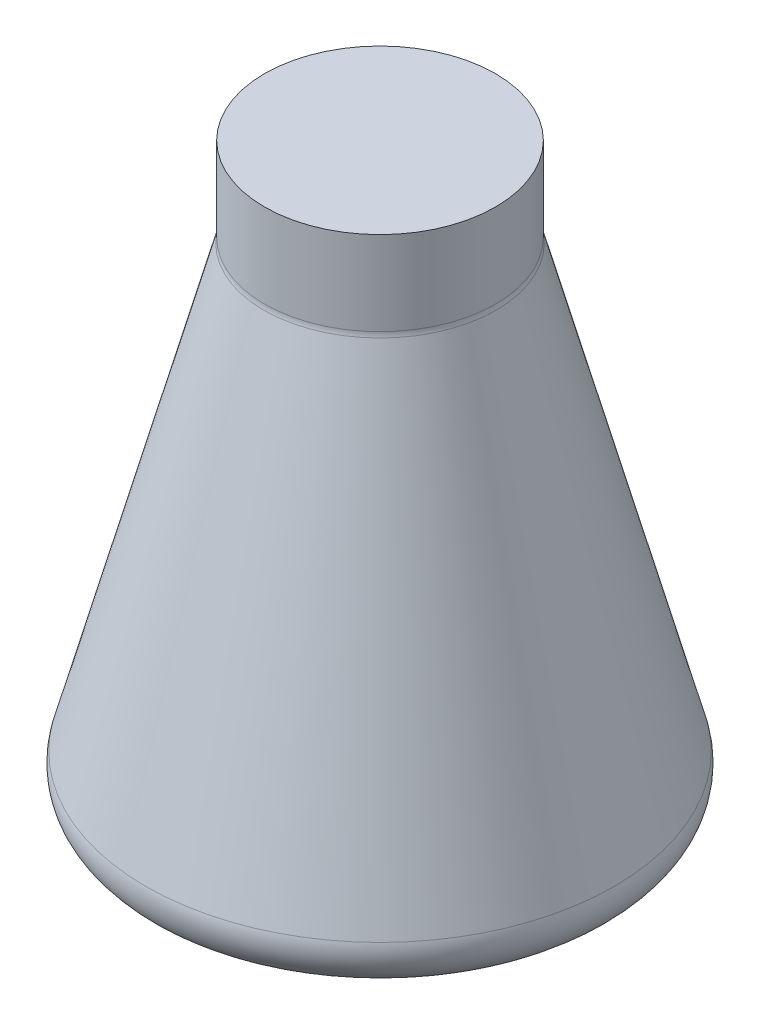
ISO-10303-21;
HEADER;
FILE_DESCRIPTION(('STEP AP214'),'2;1');
FILE_NAME('part.step','',(''),(''),'','','');
FILE_SCHEMA(('AUTOMOTIVE_DESIGN { 1 0 10303 214 1 1 1 1 }'));
ENDSEC;
DATA;
#1=APPLICATION_CONTEXT('core data for automotive mechanical design processes');
#2=APPLICATION_PROTOCOL_DEFINITION('international standard','automotive_design',2000,#1);
#3=PRODUCT_CONTEXT('',#1,'mechanical');
#4=PRODUCT('Part','Part','',(#3));
#5=PRODUCT_RELATED_PRODUCT_CATEGORY('part','',(#4));
#6=PRODUCT_DEFINITION_FORMATION('','',#4);
#7=PRODUCT_DEFINITION_CONTEXT('part definition',#1,'design');
#8=PRODUCT_DEFINITION('design','',#6,#7);
#9=PRODUCT_DEFINITION_SHAPE('','',#8);
#10=(LENGTH_UNIT() NAMED_UNIT(*) SI_UNIT(.MILLI.,.METRE.));
#11=(NAMED_UNIT(*) PLANE_ANGLE_UNIT() SI_UNIT($,.RADIAN.));
#12=(NAMED_UNIT(*) SI_UNIT($,.STERADIAN.) SOLID_ANGLE_UNIT());
#13=UNCERTAINTY_MEASURE_WITH_UNIT(LENGTH_MEASURE(1.E-05),#10,'distance_accuracy_value','');
#14=(GEOMETRIC_REPRESENTATION_CONTEXT(3) GLOBAL_UNCERTAINTY_ASSIGNED_CONTEXT((#13)) GLOBAL_UNIT_ASSIGNED_CONTEXT((#10,
#11,#12)) REPRESENTATION_CONTEXT('',''));
#15=CARTESIAN_POINT('',(0.,0.,0.));
#16=DIRECTION('',(0.,0.,1.));
#17=DIRECTION('',(1.,0.,0.));
#18=AXIS2_PLACEMENT_3D('',#15,#16,#17);
#19=CARTESIAN_POINT('',(-0.225402923333839,53.3866499632216,0.));
#20=DIRECTION('',(0.,1.,0.));
#21=DIRECTION('',(-1.,0.,0.));
#22=AXIS2_PLACEMENT_3D('',#19,#20,#21);
#23=PLANE('',#22);
#24=CARTESIAN_POINT('',(-0.225402923333839,53.3866499632216,0.));
#25=DIRECTION('',(0.,1.,0.));
#26=DIRECTION('',(-1.,0.,0.));
#27=AXIS2_PLACEMENT_3D('',#24,#25,#26);
#28=CIRCLE('',#27,60.);
#29=CARTESIAN_POINT('',(-60.2254029233338,53.3866499632216,0.));
#30=VERTEX_POINT('',#29);
#31=EDGE_CURVE('E42',#30,#30,#28,.T.);
#32=ORIENTED_EDGE('',*,*,#31,.T.);
#33=EDGE_LOOP('',(#32));
#34=FACE_BOUND('',#33,.T.);
#35=ADVANCED_FACE('F31',(#34),#23,.T.);
#36=CARTESIAN_POINT('',(-0.225402923333839,53.3866499632216,0.));
#37=DIRECTION('',(0.,1.,0.));
#38=DIRECTION('',(-1.,0.,0.));
#39=AXIS2_PLACEMENT_3D('',#36,#37,#38);
#40=CYLINDRICAL_SURFACE('',#39,60.);
#41=CARTESIAN_POINT('',(-0.225402923333834,9.70472378099676,0.));
#42=DIRECTION('',(0.,1.,0.));
#43=DIRECTION('',(-1.,0.,0.));
#44=AXIS2_PLACEMENT_3D('',#41,#42,#43);
#45=CIRCLE('',#44,60.);
#46=CARTESIAN_POINT('',(-60.2254029233338,9.70472378099675,0.));
#47=VERTEX_POINT('',#46);
#48=EDGE_CURVE('E46',#47,#47,#45,.T.);
#49=ORIENTED_EDGE('',*,*,#48,.T.);
#50=EDGE_LOOP('',(#49));
#51=FACE_BOUND('',#50,.T.);
#52=ORIENTED_EDGE('',*,*,#31,.F.);
#53=EDGE_LOOP('',(#52));
#54=FACE_BOUND('',#53,.T.);
#55=ADVANCED_FACE('F67',(#51,#54),#40,.T.);
#56=CARTESIAN_POINT('',(-0.225402923333839,9.70472378099672,0.));
#57=DIRECTION('',(0.,1.,0.));
#58=DIRECTION('',(-1.,0.,0.));
#59=AXIS2_PLACEMENT_3D('',#56,#57,#58);
#60=TOROIDAL_SURFACE('',#59,70.,10.);
#61=CARTESIAN_POINT('',(-0.225402923333834,7.11359235340606,0.));
#62=DIRECTION('',(0.,1.,0.));
#63=DIRECTION('',(-1.,0.,0.));
#64=AXIS2_PLACEMENT_3D('',#61,#62,#63);
#65=CIRCLE('',#64,60.3415302493122);
#66=CARTESIAN_POINT('',(-60.566933172646,7.11359235340606,0.));
#67=VERTEX_POINT('',#66);
#68=EDGE_CURVE('E51',#67,#67,#65,.T.);
#69=ORIENTED_EDGE('',*,*,#68,.T.);
#70=EDGE_LOOP('',(#69));
#71=FACE_BOUND('',#70,.T.);
#72=ORIENTED_EDGE('',*,*,#48,.F.);
#73=EDGE_LOOP('',(#72));
#74=FACE_BOUND('',#73,.T.);
#75=ADVANCED_FACE('F55',(#71,#74),#60,.F.);
#76=CARTESIAN_POINT('',(-0.225402923333834,7.11359235340606,0.));
#77=DIRECTION('',(0.,-1.,0.));
#78=DIRECTION('',(1.,0.,0.));
#79=AXIS2_PLACEMENT_3D('',#76,#77,#78);
#80=CONICAL_SURFACE('',#79,60.3415302493122,0.262103872523297);
#81=CARTESIAN_POINT('',(-0.225402923333806,-221.431087181597,0.));
#82=DIRECTION('',(0.,1.,0.));
#83=DIRECTION('',(-1.,0.,0.));
#84=AXIS2_PLACEMENT_3D('',#81,#82,#83);
#85=CIRCLE('',#84,121.654483236466);
#86=CARTESIAN_POINT('',(-121.8798861598,-221.431087181597,0.));
#87=VERTEX_POINT('',#86);
#88=EDGE_CURVE('E38',#87,#87,#85,.T.);
#89=ORIENTED_EDGE('',*,*,#88,.T.);
#90=EDGE_LOOP('',(#89));
#91=FACE_BOUND('',#90,.T.);
#92=ORIENTED_EDGE('',*,*,#68,.F.);
#93=EDGE_LOOP('',(#92));
#94=FACE_BOUND('',#93,.T.);
#95=ADVANCED_FACE('F58',(#91,#94),#80,.T.);
#96=CARTESIAN_POINT('',(-128.635671950532,-246.613350036778,0.));
#97=DIRECTION('',(0.,-1.,0.));
#98=DIRECTION('',(1.,0.,0.));
#99=AXIS2_PLACEMENT_3D('',#96,#97,#98);
#100=PLANE('',#99);
#101=CARTESIAN_POINT('',(-0.225402923333803,-246.613350036778,0.));
#102=DIRECTION('',(0.,-1.,0.));
#103=DIRECTION('',(1.,0.,0.));
#104=AXIS2_PLACEMENT_3D('',#101,#102,#103);
#105=CIRCLE('',#104,102.337543735091);
#106=CARTESIAN_POINT('',(102.112140811757,-246.613350036778,0.));
#107=VERTEX_POINT('',#106);
#108=EDGE_CURVE('E10',#107,#107,#105,.T.);
#109=ORIENTED_EDGE('',*,*,#108,.T.);
#110=EDGE_LOOP('',(#109));
#111=FACE_BOUND('',#110,.T.);
#112=ADVANCED_FACE('F60',(#111),#100,.T.);
#113=CARTESIAN_POINT('',(-0.225402923333805,-226.613350036778,0.));
#114=DIRECTION('',(0.,-1.,0.));
#115=DIRECTION('',(1.,0.,0.));
#116=AXIS2_PLACEMENT_3D('',#113,#114,#115);
#117=TOROIDAL_SURFACE('',#116,102.337543735091,20.);
#118=ORIENTED_EDGE('',*,*,#108,.F.);
#119=EDGE_LOOP('',(#118));
#120=FACE_BOUND('',#119,.T.);
#121=ORIENTED_EDGE('',*,*,#88,.F.);
#122=EDGE_LOOP('',(#121));
#123=FACE_BOUND('',#122,.T.);
#124=ADVANCED_FACE('F33',(#120,#123),#117,.T.);
#125=CLOSED_SHELL('',(#35,#55,#75,#95,#112,#124));
#126=MANIFOLD_SOLID_BREP('B2',#125);
#127=ADVANCED_BREP_SHAPE_REPRESENTATION('',(#18,#126),#14);
#128=SHAPE_DEFINITION_REPRESENTATION(#9,#127);
ENDSEC;
END-ISO-10303-21;
